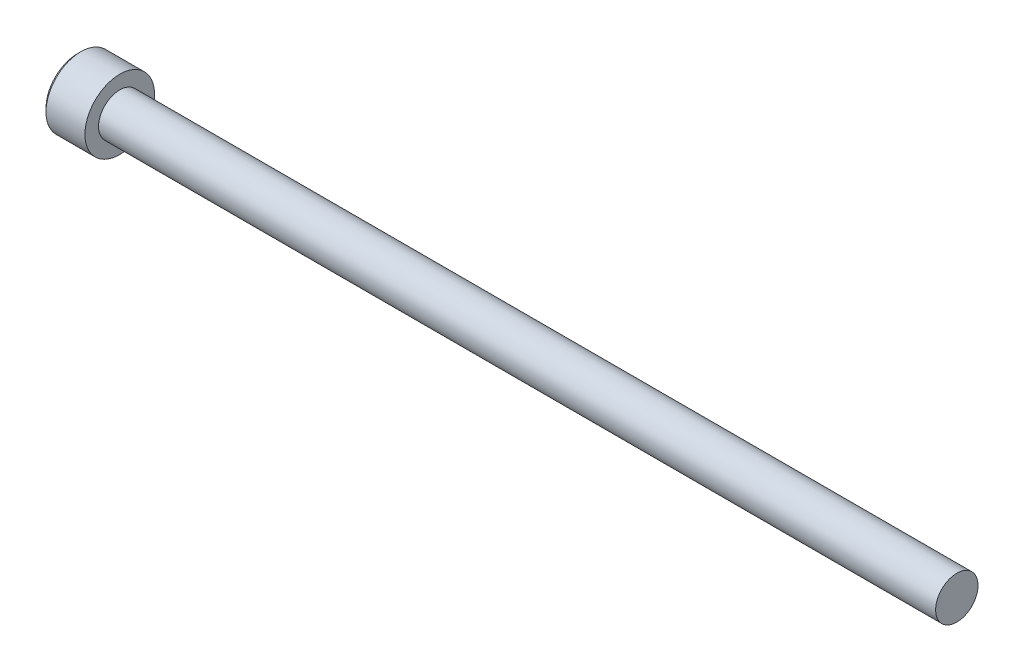
ISO-10303-21;
HEADER;
FILE_DESCRIPTION(('STEP AP214'),'2;1');
FILE_NAME('part.step','',(''),(''),'','','');
FILE_SCHEMA(('AUTOMOTIVE_DESIGN { 1 0 10303 214 1 1 1 1 }'));
ENDSEC;
DATA;
#1=APPLICATION_CONTEXT('core data for automotive mechanical design processes');
#2=APPLICATION_PROTOCOL_DEFINITION('international standard','automotive_design',2000,#1);
#3=PRODUCT_CONTEXT('',#1,'mechanical');
#4=PRODUCT('Part','Part','',(#3));
#5=PRODUCT_RELATED_PRODUCT_CATEGORY('part','',(#4));
#6=PRODUCT_DEFINITION_FORMATION('','',#4);
#7=PRODUCT_DEFINITION_CONTEXT('part definition',#1,'design');
#8=PRODUCT_DEFINITION('design','',#6,#7);
#9=PRODUCT_DEFINITION_SHAPE('','',#8);
#10=(LENGTH_UNIT() NAMED_UNIT(*) SI_UNIT(.MILLI.,.METRE.));
#11=(NAMED_UNIT(*) PLANE_ANGLE_UNIT() SI_UNIT($,.RADIAN.));
#12=(NAMED_UNIT(*) SI_UNIT($,.STERADIAN.) SOLID_ANGLE_UNIT());
#13=UNCERTAINTY_MEASURE_WITH_UNIT(LENGTH_MEASURE(1.E-05),#10,'distance_accuracy_value','');
#14=(GEOMETRIC_REPRESENTATION_CONTEXT(3) GLOBAL_UNCERTAINTY_ASSIGNED_CONTEXT((#13)) GLOBAL_UNIT_ASSIGNED_CONTEXT((#10,
#11,#12)) REPRESENTATION_CONTEXT('',''));
#15=CARTESIAN_POINT('',(0.,0.,0.));
#16=DIRECTION('',(0.,0.,1.));
#17=DIRECTION('',(1.,0.,0.));
#18=AXIS2_PLACEMENT_3D('',#15,#16,#17);
#19=CARTESIAN_POINT('',(-2.28600000000007,-1.14567944042317,1.984375));
#20=DIRECTION('',(0.,0.,1.));
#21=DIRECTION('',(1.,0.,0.));
#22=AXIS2_PLACEMENT_3D('',#19,#20,#21);
#23=PLANE('',#22);
#24=CARTESIAN_POINT('',(-4.82599999995852,1.14567944044653,1.98437499999554));
#25=CARTESIAN_POINT('',(-4.78691618362732,1.06743880343266,1.9843749999984));
#26=CARTESIAN_POINT('',(-4.75011447684892,0.987898318960917,1.98437499999957));
#27=CARTESIAN_POINT('',(-4.68265620500518,0.825677042028778,1.98437500000043));
#28=CARTESIAN_POINT('',(-4.65204056061138,0.742979382529199,1.98437500000012));
#29=CARTESIAN_POINT('',(-4.5991739228306,0.575193959555969,1.98437499999988));
#30=CARTESIAN_POINT('',(-4.57689462080725,0.490115359117279,1.98437499999997));
#31=CARTESIAN_POINT('',(-4.54259467221837,0.318093091130193,1.98437500000003));
#32=CARTESIAN_POINT('',(-4.5305423022885,0.231156054976726,1.984375));
#33=CARTESIAN_POINT('',(-4.52249110263747,0.119918521511051,1.984375));
#34=CARTESIAN_POINT('',(-4.52118947557477,0.0959468443046798,1.984375));
#35=CARTESIAN_POINT('',(-4.51945182629813,0.0479845644411998,1.984375));
#36=CARTESIAN_POINT('',(-4.51901533386223,0.0239939791589393,1.984375));
#37=CARTESIAN_POINT('',(-4.51901809008399,-0.0602201717457363,1.984375));
#38=CARTESIAN_POINT('',(-4.52177452299902,-0.120461721905447,1.984375));
#39=CARTESIAN_POINT('',(-4.5326365512493,-0.240474970989197,1.984375));
#40=CARTESIAN_POINT('',(-4.54074587749718,-0.300246312758427,1.984375));
#41=CARTESIAN_POINT('',(-4.57259622946939,-0.478763752804282,1.984375));
#42=CARTESIAN_POINT('',(-4.60385422611702,-0.596208828937734,1.984375));
#43=CARTESIAN_POINT('',(-4.66780003592237,-0.785921487441256,1.984375));
#44=CARTESIAN_POINT('',(-4.69623457768558,-0.859734609866899,1.984375));
#45=CARTESIAN_POINT('',(-4.75786140400812,-1.00456595519282,1.984375));
#46=CARTESIAN_POINT('',(-4.79100779300359,-1.07560356657101,1.984375));
#47=CARTESIAN_POINT('',(-4.82599999995643,-1.14567944044724,1.984375));
#48=B_SPLINE_CURVE_WITH_KNOTS('',3,(#24,#25,#26,#27,#28,#29,#30,#31,#32,#33,#34,#35,#36,#37,#38,
#39,#40,#41,#42,#43,#44,#45,#46,#47),.UNSPECIFIED.,.F.,.F.,(4,2,2,2,2,2,2,2,2,2,2,4),(0.,
0.262559005207405,0.526801735838036,0.790138824405318,1.05265603861765,1.12466619182083,
1.19663719499031,1.3772702672652,1.55802937209382,1.92104085090328,2.15819130092264,
2.39317265078575),.UNSPECIFIED.);
#49=CARTESIAN_POINT('',(-4.82599999996829,1.14567944041753,1.98437500003084));
#50=VERTEX_POINT('',#49);
#51=CARTESIAN_POINT('',(-4.8259999999622,-1.14567944043207,1.98437500001542));
#52=VERTEX_POINT('',#51);
#53=EDGE_CURVE('E21',#50,#52,#48,.T.);
#54=ORIENTED_EDGE('',*,*,#53,.F.);
#55=DIRECTION('',(1.,0.,0.));
#56=VECTOR('',#55,1.);
#57=CARTESIAN_POINT('',(-2.28600000000007,1.14567944042316,1.984375));
#58=LINE('',#57,#56);
#59=CARTESIAN_POINT('',(-2.28600000000007,1.14567944042316,1.984375));
#60=VERTEX_POINT('',#59);
#61=EDGE_CURVE('E70',#50,#60,#58,.T.);
#62=ORIENTED_EDGE('',*,*,#61,.T.);
#63=DIRECTION('',(0.,1.,0.));
#64=VECTOR('',#63,1.);
#65=CARTESIAN_POINT('',(-2.28600000000007,0.,1.984375));
#66=LINE('',#65,#64);
#67=CARTESIAN_POINT('',(-2.28600000000007,-1.14567944042317,1.984375));
#68=VERTEX_POINT('',#67);
#69=EDGE_CURVE('E76',#68,#60,#66,.T.);
#70=ORIENTED_EDGE('',*,*,#69,.F.);
#71=DIRECTION('',(1.,0.,0.));
#72=VECTOR('',#71,1.);
#73=CARTESIAN_POINT('',(-2.28600000000007,-1.14567944042317,1.984375));
#74=LINE('',#73,#72);
#75=EDGE_CURVE('E73',#68,#52,#74,.F.);
#76=ORIENTED_EDGE('',*,*,#75,.T.);
#77=EDGE_LOOP('',(#54,#62,#70,#76));
#78=FACE_BOUND('',#77,.T.);
#79=ADVANCED_FACE('F17',(#78),#23,.F.);
#80=CARTESIAN_POINT('',(-2.28600000000007,0.,0.));
#81=DIRECTION('',(-1.,0.,0.));
#82=DIRECTION('',(0.,0.,1.));
#83=AXIS2_PLACEMENT_3D('',#80,#81,#82);
#84=PLANE('',#83);
#85=DIRECTION('',(0.,0.5,0.866025403784439));
#86=VECTOR('',#85,1.);
#87=CARTESIAN_POINT('',(-2.28600000000007,2.29135888084633,0.));
#88=LINE('',#87,#86);
#89=CARTESIAN_POINT('',(-2.28600000000007,2.29135888084633,0.));
#90=VERTEX_POINT('',#89);
#91=CARTESIAN_POINT('',(-2.28600000000007,1.14567944042316,-1.984375));
#92=VERTEX_POINT('',#91);
#93=EDGE_CURVE('E84',#90,#92,#88,.F.);
#94=ORIENTED_EDGE('',*,*,#93,.T.);
#95=DIRECTION('',(0.,1.,0.));
#96=VECTOR('',#95,1.);
#97=CARTESIAN_POINT('',(-2.28600000000007,1.14567944042316,-1.984375));
#98=LINE('',#97,#96);
#99=CARTESIAN_POINT('',(-2.28600000000007,-1.14567944042316,-1.984375));
#100=VERTEX_POINT('',#99);
#101=EDGE_CURVE('E249',#92,#100,#98,.F.);
#102=ORIENTED_EDGE('',*,*,#101,.T.);
#103=DIRECTION('',(0.,0.5,-0.866025403784439));
#104=VECTOR('',#103,1.);
#105=CARTESIAN_POINT('',(-2.28600000000007,-1.14567944042316,-1.984375));
#106=LINE('',#105,#104);
#107=CARTESIAN_POINT('',(-2.28600000000007,-2.29135888084633,0.));
#108=VERTEX_POINT('',#107);
#109=EDGE_CURVE('E234',#100,#108,#106,.F.);
#110=ORIENTED_EDGE('',*,*,#109,.T.);
#111=DIRECTION('',(0.,-0.5,-0.866025403784439));
#112=VECTOR('',#111,1.);
#113=CARTESIAN_POINT('',(-2.28600000000007,-2.29135888084633,0.));
#114=LINE('',#113,#112);
#115=EDGE_CURVE('E231',#108,#68,#114,.F.);
#116=ORIENTED_EDGE('',*,*,#115,.T.);
#117=ORIENTED_EDGE('',*,*,#69,.T.);
#118=DIRECTION('',(0.,-0.5,0.866025403784439));
#119=VECTOR('',#118,1.);
#120=CARTESIAN_POINT('',(-2.28600000000007,1.14567944042316,1.984375));
#121=LINE('',#120,#119);
#122=EDGE_CURVE('E83',#60,#90,#121,.F.);
#123=ORIENTED_EDGE('',*,*,#122,.T.);
#124=EDGE_LOOP('',(#94,#102,#110,#116,#117,#123));
#125=FACE_BOUND('',#124,.T.);
#126=ADVANCED_FACE('F166',(#125),#84,.T.);
#127=CARTESIAN_POINT('',(-2.28600000000007,-1.14567944042316,-1.984375));
#128=DIRECTION('',(0.,-0.866025403784439,-0.5));
#129=DIRECTION('',(0.,0.5,-0.866025403784439));
#130=AXIS2_PLACEMENT_3D('',#127,#128,#129);
#131=PLANE('',#130);
#132=CARTESIAN_POINT('',(-4.82599999995871,-1.14567944040756,-1.98437500001887));
#133=CARTESIAN_POINT('',(-4.78666022792997,-1.18505700230148,-1.91617106214563));
#134=CARTESIAN_POINT('',(-4.74963132844072,-1.22509295783734,-1.8468267530301));
#135=CARTESIAN_POINT('',(-4.68183299424977,-1.30673037975396,-1.70542659047317));
#136=CARTESIAN_POINT('',(-4.65110127019237,-1.34833960561553,-1.63335729721673));
#137=CARTESIAN_POINT('',(-4.59845762010516,-1.432242568594,-1.48803310243203));
#138=CARTESIAN_POINT('',(-4.57641341195893,-1.47451494967301,-1.41481519064643));
#139=CARTESIAN_POINT('',(-4.5424501106744,-1.55999007976842,-1.26676792253773));
#140=CARTESIAN_POINT('',(-4.53050567471972,-1.6031902195197,-1.19194308559438));
#141=CARTESIAN_POINT('',(-4.51972842752365,-1.67764765054852,-1.06297903205139));
#142=CARTESIAN_POINT('',(-4.51813352794835,-1.70880881707173,-1.00900630841009));
#143=CARTESIAN_POINT('',(-4.52082392138599,-1.77108016542046,-0.901149169214274));
#144=CARTESIAN_POINT('',(-4.52511127545884,-1.80219032554946,-0.847264791239237));
#145=CARTESIAN_POINT('',(-4.53932219421538,-1.86411684097343,-0.740004920189235));
#146=CARTESIAN_POINT('',(-4.54925206045723,-1.8949328285454,-0.686630064029166));
#147=CARTESIAN_POINT('',(-4.5742029484467,-1.95603190279815,-0.580803363127977));
#148=CARTESIAN_POINT('',(-4.58922357974385,-1.98631503016081,-0.528351447923769));
#149=CARTESIAN_POINT('',(-4.63380478900425,-2.06386502548479,-0.394030915895904));
#150=CARTESIAN_POINT('',(-4.66672213384104,-2.11065153226583,-0.312994309042483));
#151=CARTESIAN_POINT('',(-4.72228952038986,-2.17944749410732,-0.193836207777459));
#152=CARTESIAN_POINT('',(-4.74181309375939,-2.20211890802843,-0.154568166986659));
#153=CARTESIAN_POINT('',(-4.78263970065987,-2.24704195201531,-0.076759172370747));
#154=CARTESIAN_POINT('',(-4.80394164363173,-2.2692938292399,-0.038217790453971));
#155=CARTESIAN_POINT('',(-4.82599999995675,-2.29135888085868,2.13931096249392E-11));
#156=B_SPLINE_CURVE_WITH_KNOTS('',3,(#132,#133,#134,#135,#136,#137,#138,#139,#140,#141,#142,
#143,#144,#145,#146,#147,#148,#149,#150,#151,#152,#153,#154,#155),.UNSPECIFIED.,.F.,.F.,(4,2,2,
2,2,2,2,2,2,2,2,4),(0.,0.264284909626495,0.530108996358093,0.791712695414127,1.05265800174404,
1.23942150116703,1.42625045663858,1.61328847394198,1.80031214908683,2.09727151182814,
2.24534838946042,2.39333511890876),.UNSPECIFIED.);
#157=CARTESIAN_POINT('',(-4.8259999999622,-1.14567944043207,-1.98437500001542));
#158=VERTEX_POINT('',#157);
#159=CARTESIAN_POINT('',(-4.82599999996846,-2.2913588808704,-2.0004354349219E-11));
#160=VERTEX_POINT('',#159);
#161=EDGE_CURVE('E168',#158,#160,#156,.T.);
#162=ORIENTED_EDGE('',*,*,#161,.T.);
#163=DIRECTION('',(1.,0.,0.));
#164=VECTOR('',#163,1.);
#165=CARTESIAN_POINT('',(-2.28600000000007,-2.29135888084633,0.));
#166=LINE('',#165,#164);
#167=EDGE_CURVE('E242',#160,#108,#166,.T.);
#168=ORIENTED_EDGE('',*,*,#167,.T.);
#169=ORIENTED_EDGE('',*,*,#109,.F.);
#170=DIRECTION('',(-1.,0.,0.));
#171=VECTOR('',#170,1.);
#172=CARTESIAN_POINT('',(-2.28600000000007,-1.14567944042316,-1.984375));
#173=LINE('',#172,#171);
#174=EDGE_CURVE('E252',#100,#158,#173,.T.);
#175=ORIENTED_EDGE('',*,*,#174,.T.);
#176=EDGE_LOOP('',(#162,#168,#169,#175));
#177=FACE_BOUND('',#176,.T.);
#178=ADVANCED_FACE('F162',(#177),#131,.F.);
#179=CARTESIAN_POINT('',(-2.28600000000007,-2.29135888084633,0.));
#180=DIRECTION('',(0.,-0.866025403784439,0.5));
#181=DIRECTION('',(0.,-0.5,-0.866025403784439));
#182=AXIS2_PLACEMENT_3D('',#179,#180,#181);
#183=PLANE('',#182);
#184=CARTESIAN_POINT('',(-4.8259999999587,-2.29135888085486,-2.29477011545215E-11));
#185=CARTESIAN_POINT('',(-4.78666022792997,-2.25198131896546,0.0682039378529047));
#186=CARTESIAN_POINT('',(-4.74963132844072,-2.21194536343147,0.137548246969502));
#187=CARTESIAN_POINT('',(-4.68183299424977,-2.13030794151622,0.278948409527228));
#188=CARTESIAN_POINT('',(-4.65110127019237,-2.08869871565414,0.351017702783377));
#189=CARTESIAN_POINT('',(-4.59845762010516,-2.00479575267531,0.496341897567867));
#190=CARTESIAN_POINT('',(-4.57641341195893,-1.96252337159644,0.569559809353539));
#191=CARTESIAN_POINT('',(-4.5424501106744,-1.87704824150112,0.717607077462299));
#192=CARTESIAN_POINT('',(-4.53050567471972,-1.8338481017498,0.792431914405622));
#193=CARTESIAN_POINT('',(-4.51972842752365,-1.75939067072096,0.921395967948603));
#194=CARTESIAN_POINT('',(-4.51813352794834,-1.72822950419776,0.975368691589913));
#195=CARTESIAN_POINT('',(-4.52082392138599,-1.66595815584903,1.08322583078573));
#196=CARTESIAN_POINT('',(-4.52511127545884,-1.63484799572003,1.13711020876076));
#197=CARTESIAN_POINT('',(-4.53932219421538,-1.57292148029607,1.24437007981077));
#198=CARTESIAN_POINT('',(-4.54925206045723,-1.54210549272409,1.29774493597084));
#199=CARTESIAN_POINT('',(-4.5742029484467,-1.48100641847134,1.40357163687202));
#200=CARTESIAN_POINT('',(-4.58922357974385,-1.45072329110868,1.45602355207623));
#201=CARTESIAN_POINT('',(-4.63380478900421,-1.37317329578476,1.59034408410398));
#202=CARTESIAN_POINT('',(-4.66672213384095,-1.32638678900379,1.6713806909573));
#203=CARTESIAN_POINT('',(-4.72228952038968,-1.25759082716239,1.79053879222216));
#204=CARTESIAN_POINT('',(-4.74181309375917,-1.23491941324131,1.82980683301291));
#205=CARTESIAN_POINT('',(-4.78263970065959,-1.18999636925449,1.90761582762872));
#206=CARTESIAN_POINT('',(-4.8039416436314,-1.16774449202993,1.94615720954545));
#207=CARTESIAN_POINT('',(-4.82599999995639,-1.14567944041117,1.98437500002077));
#208=B_SPLINE_CURVE_WITH_KNOTS('',3,(#184,#185,#186,#187,#188,#189,#190,#191,#192,#193,#194,
#195,#196,#197,#198,#199,#200,#201,#202,#203,#204,#205,#206,#207),.UNSPECIFIED.,.F.,.F.,(4,2,2,
2,2,2,2,2,2,2,2,4),(0.,0.264284909626493,0.530108996358089,0.791712695414125,1.05265800174404,
1.23942150116703,1.42625045663858,1.61328847394198,1.80031214908683,2.09727151182773,
2.24534838945981,2.39333511890795),.UNSPECIFIED.);
#209=EDGE_CURVE('E93',#160,#52,#208,.T.);
#210=ORIENTED_EDGE('',*,*,#209,.T.);
#211=ORIENTED_EDGE('',*,*,#75,.F.);
#212=ORIENTED_EDGE('',*,*,#115,.F.);
#213=ORIENTED_EDGE('',*,*,#167,.F.);
#214=EDGE_LOOP('',(#210,#211,#212,#213));
#215=FACE_BOUND('',#214,.T.);
#216=ADVANCED_FACE('F157',(#215),#183,.F.);
#217=CARTESIAN_POINT('',(-2.28600000000007,1.14567944042316,1.984375));
#218=DIRECTION('',(0.,0.866025403784439,0.5));
#219=DIRECTION('',(0.,-0.5,0.866025403784439));
#220=AXIS2_PLACEMENT_3D('',#217,#218,#219);
#221=PLANE('',#220);
#222=CARTESIAN_POINT('',(-4.82599999995852,1.14567944040762,1.98437500001801));
#223=CARTESIAN_POINT('',(-4.78666022792973,1.1850570023017,1.91617106214498));
#224=CARTESIAN_POINT('',(-4.74963132844047,1.22509295783761,1.84682675302957));
#225=CARTESIAN_POINT('',(-4.68183299424957,1.30673037975422,1.70542659047278));
#226=CARTESIAN_POINT('',(-4.65110127019222,1.34833960561574,1.63335729721638));
#227=CARTESIAN_POINT('',(-4.59845762010509,1.43224256859413,1.48803310243178));
#228=CARTESIAN_POINT('',(-4.57641341195888,1.47451494967311,1.41481519064625));
#229=CARTESIAN_POINT('',(-4.54245011067439,1.55999007976846,1.26676792253767));
#230=CARTESIAN_POINT('',(-4.53050567471972,1.6031902195197,1.19194308559439));
#231=CARTESIAN_POINT('',(-4.51972842752365,1.67764765054848,1.06297903205146));
#232=CARTESIAN_POINT('',(-4.51813352794835,1.70880881707169,1.00900630841016));
#233=CARTESIAN_POINT('',(-4.52082392138598,1.77108016542041,0.901149169214364));
#234=CARTESIAN_POINT('',(-4.52511127545883,1.80219032554941,0.847264791239333));
#235=CARTESIAN_POINT('',(-4.53932219421536,1.86411684097336,0.740004920189342));
#236=CARTESIAN_POINT('',(-4.54925206045721,1.89493282854533,0.686630064029279));
#237=CARTESIAN_POINT('',(-4.57420294844667,1.95603190279808,0.580803363128101));
#238=CARTESIAN_POINT('',(-4.58922357974382,1.98631503016074,0.528351447923897));
#239=CARTESIAN_POINT('',(-4.6338047890042,2.06386502548473,0.394030915896012));
#240=CARTESIAN_POINT('',(-4.666722133841,2.11065153226578,0.312994309042568));
#241=CARTESIAN_POINT('',(-4.72228952038984,2.17944749410729,0.19383620777751));
#242=CARTESIAN_POINT('',(-4.74181309375937,2.20211890802841,0.1545681669867));
#243=CARTESIAN_POINT('',(-4.78263970065986,2.24704195201529,0.0767591723707675));
#244=CARTESIAN_POINT('',(-4.80394164363172,2.26929382923989,0.0382177904539812));
#245=CARTESIAN_POINT('',(-4.82599999995675,2.29135888085868,-2.13928869462937E-11));
#246=B_SPLINE_CURVE_WITH_KNOTS('',3,(#222,#223,#224,#225,#226,#227,#228,#229,#230,#231,#232,
#233,#234,#235,#236,#237,#238,#239,#240,#241,#242,#243,#244,#245),.UNSPECIFIED.,.F.,.F.,(4,2,2,
2,2,2,2,2,2,2,2,4),(0.,0.26428490962629,0.530108996357672,0.791712695413487,1.05265800174319,
1.23942150116616,1.42625045663768,1.61328847394106,1.80031214908589,2.09727151182728,
2.2453483894596,2.39333511890798),.UNSPECIFIED.);
#247=CARTESIAN_POINT('',(-4.82599999996846,2.29135888087039,2.00042061036289E-11));
#248=VERTEX_POINT('',#247);
#249=EDGE_CURVE('E81',#50,#248,#246,.T.);
#250=ORIENTED_EDGE('',*,*,#249,.T.);
#251=DIRECTION('',(1.,0.,0.));
#252=VECTOR('',#251,1.);
#253=CARTESIAN_POINT('',(-2.28600000000007,2.29135888084633,0.));
#254=LINE('',#253,#252);
#255=EDGE_CURVE('E253',#248,#90,#254,.T.);
#256=ORIENTED_EDGE('',*,*,#255,.T.);
#257=ORIENTED_EDGE('',*,*,#122,.F.);
#258=ORIENTED_EDGE('',*,*,#61,.F.);
#259=EDGE_LOOP('',(#250,#256,#257,#258));
#260=FACE_BOUND('',#259,.T.);
#261=ADVANCED_FACE('F78',(#260),#221,.F.);
#262=CARTESIAN_POINT('',(-2.28600000000007,2.29135888084633,0.));
#263=DIRECTION('',(0.,0.866025403784439,-0.5));
#264=DIRECTION('',(0.,0.5,0.866025403784439));
#265=AXIS2_PLACEMENT_3D('',#262,#263,#264);
#266=PLANE('',#265);
#267=CARTESIAN_POINT('',(-4.82599999995871,2.29135888085486,2.29489280696873E-11));
#268=CARTESIAN_POINT('',(-4.78666022792997,2.25198131896546,-0.0682039378529041));
#269=CARTESIAN_POINT('',(-4.74963132844072,2.21194536343147,-0.137548246969502));
#270=CARTESIAN_POINT('',(-4.68183299424977,2.13030794151622,-0.278948409527229));
#271=CARTESIAN_POINT('',(-4.65110127019237,2.08869871565414,-0.351017702783379));
#272=CARTESIAN_POINT('',(-4.59845762010516,2.00479575267531,-0.496341897567869));
#273=CARTESIAN_POINT('',(-4.57641341195893,1.96252337159644,-0.569559809353541));
#274=CARTESIAN_POINT('',(-4.5424501106744,1.87704824150112,-0.7176070774623));
#275=CARTESIAN_POINT('',(-4.53050567471972,1.8338481017498,-0.792431914405622));
#276=CARTESIAN_POINT('',(-4.51972842752365,1.75939067072096,-0.921395967948602));
#277=CARTESIAN_POINT('',(-4.51813352794835,1.72822950419776,-0.975368691589912));
#278=CARTESIAN_POINT('',(-4.52082392138599,1.66595815584903,-1.08322583078573));
#279=CARTESIAN_POINT('',(-4.52511127545884,1.63484799572003,-1.13711020876076));
#280=CARTESIAN_POINT('',(-4.53932219421538,1.57292148029607,-1.24437007981077));
#281=CARTESIAN_POINT('',(-4.54925206045723,1.54210549272409,-1.29774493597083));
#282=CARTESIAN_POINT('',(-4.5742029484467,1.48100641847134,-1.40357163687202));
#283=CARTESIAN_POINT('',(-4.58922357974385,1.45072329110868,-1.45602355207623));
#284=CARTESIAN_POINT('',(-4.63380478900425,1.3731732957847,-1.5903440841041));
#285=CARTESIAN_POINT('',(-4.66672213384104,1.32638678900366,-1.67138069095752));
#286=CARTESIAN_POINT('',(-4.72228952038986,1.25759082716218,-1.79053879222254));
#287=CARTESIAN_POINT('',(-4.74181309375939,1.23491941324106,-1.82980683301334));
#288=CARTESIAN_POINT('',(-4.78263970065987,1.18999636925419,-1.90761582762925));
#289=CARTESIAN_POINT('',(-4.80394164363173,1.1677444920296,-1.94615720954603));
#290=CARTESIAN_POINT('',(-4.82599999995675,1.14567944041081,-1.98437500002139));
#291=B_SPLINE_CURVE_WITH_KNOTS('',3,(#267,#268,#269,#270,#271,#272,#273,#274,#275,#276,#277,
#278,#279,#280,#281,#282,#283,#284,#285,#286,#287,#288,#289,#290),.UNSPECIFIED.,.F.,.F.,(4,2,2,
2,2,2,2,2,2,2,2,4),(0.,0.264284909626495,0.530108996358094,0.791712695414128,1.05265800174404,
1.23942150116703,1.42625045663858,1.61328847394198,1.80031214908683,2.09727151182814,
2.24534838946042,2.39333511890876),.UNSPECIFIED.);
#292=CARTESIAN_POINT('',(-4.82599999996846,1.14567944045252,-1.98437500001084));
#293=VERTEX_POINT('',#292);
#294=EDGE_CURVE('E41',#248,#293,#291,.T.);
#295=ORIENTED_EDGE('',*,*,#294,.T.);
#296=DIRECTION('',(-1.,0.,0.));
#297=VECTOR('',#296,1.);
#298=CARTESIAN_POINT('',(-2.28600000000007,1.14567944042316,-1.984375));
#299=LINE('',#298,#297);
#300=EDGE_CURVE('E173',#293,#92,#299,.F.);
#301=ORIENTED_EDGE('',*,*,#300,.T.);
#302=ORIENTED_EDGE('',*,*,#93,.F.);
#303=ORIENTED_EDGE('',*,*,#255,.F.);
#304=EDGE_LOOP('',(#295,#301,#302,#303));
#305=FACE_BOUND('',#304,.T.);
#306=ADVANCED_FACE('F156',(#305),#266,.F.);
#307=CARTESIAN_POINT('',(-2.28600000000007,1.14567944042316,-1.984375));
#308=DIRECTION('',(0.,0.,-1.));
#309=DIRECTION('',(-1.,0.,0.));
#310=AXIS2_PLACEMENT_3D('',#307,#308,#309);
#311=PLANE('',#310);
#312=CARTESIAN_POINT('',(-4.8259999999587,1.14567944044731,-1.98437499999592));
#313=CARTESIAN_POINT('',(-4.78666022793094,1.06692431665146,-1.98437499999853));
#314=CARTESIAN_POINT('',(-4.74963132844318,0.986852405569011,-1.98437499999961));
#315=CARTESIAN_POINT('',(-4.6818329942566,0.823577561711963,-1.9843750000004));
#316=CARTESIAN_POINT('',(-4.65110127020207,0.740359109975722,-1.98437500000011));
#317=CARTESIAN_POINT('',(-4.59845762012233,0.572553183993917,-1.9843749999999));
#318=CARTESIAN_POINT('',(-4.57641341198063,0.488008421824127,-1.98437499999997));
#319=CARTESIAN_POINT('',(-4.54245011070673,0.317058161610178,-1.98437500000003));
#320=CARTESIAN_POINT('',(-4.53050567475816,0.230657882096267,-1.98437500000001));
#321=CARTESIAN_POINT('',(-4.51972842757294,0.0817430200124032,-1.984375));
#322=CARTESIAN_POINT('',(-4.51813352800283,0.0194206869508218,-1.984375));
#323=CARTESIAN_POINT('',(-4.52082392145254,-0.1051220097764,-1.984375));
#324=CARTESIAN_POINT('',(-4.52511127553227,-0.167342330049008,-1.984375));
#325=CARTESIAN_POINT('',(-4.53932219430377,-0.291195360925477,-1.984375));
#326=CARTESIAN_POINT('',(-4.54925206055372,-0.352827336083362,-1.984375));
#327=CARTESIAN_POINT('',(-4.57420294856008,-0.475025484616114,-1.984375));
#328=CARTESIAN_POINT('',(-4.58922357986604,-0.535591739354747,-1.984375));
#329=CARTESIAN_POINT('',(-4.63380478912724,-0.690691729958653,-1.984375));
#330=CARTESIAN_POINT('',(-4.66672213394715,-0.784264743465576,-1.984375));
#331=CARTESIAN_POINT('',(-4.7222895204619,-0.921856667069616,-1.984375));
#332=CARTESIAN_POINT('',(-4.74181309381856,-0.967199494886089,-1.984375));
#333=CARTESIAN_POINT('',(-4.78263970069104,-1.05704558280959,-1.984375));
#334=CARTESIAN_POINT('',(-4.80394164364776,-1.10154933723428,-1.984375));
#335=CARTESIAN_POINT('',(-4.82599999995675,-1.14567944044787,-1.984375));
#336=B_SPLINE_CURVE_WITH_KNOTS('',3,(#312,#313,#314,#315,#316,#317,#318,#319,#320,#321,#322,
#323,#324,#325,#326,#327,#328,#329,#330,#331,#332,#333,#334,#335),.UNSPECIFIED.,.F.,.F.,(4,2,2,
2,2,2,2,2,2,2,2,4),(0.,0.264284909658836,0.530108996422784,0.791712695509868,1.0526580018708,
1.23942150133878,1.42625045685537,1.61328847420389,1.80031214939384,2.09727151196384,
2.24534838950992,2.39333511887245),.UNSPECIFIED.);
#337=EDGE_CURVE('E110',#293,#158,#336,.T.);
#338=ORIENTED_EDGE('',*,*,#337,.T.);
#339=ORIENTED_EDGE('',*,*,#174,.F.);
#340=ORIENTED_EDGE('',*,*,#101,.F.);
#341=ORIENTED_EDGE('',*,*,#300,.F.);
#342=EDGE_LOOP('',(#338,#339,#340,#341));
#343=FACE_BOUND('',#342,.T.);
#344=ADVANCED_FACE('F125',(#343),#311,.F.);
#345=CARTESIAN_POINT('',(-4.82599999998001,0.,0.));
#346=DIRECTION('',(-1.,0.,0.));
#347=DIRECTION('',(0.,0.,1.));
#348=AXIS2_PLACEMENT_3D('',#345,#346,#347);
#349=CONICAL_SURFACE('',#348,2.29135888088194,0.785398163397448);
#350=ORIENTED_EDGE('',*,*,#161,.F.);
#351=CARTESIAN_POINT('',(-4.82599999998001,0.,0.));
#352=DIRECTION('',(-1.,0.,0.));
#353=DIRECTION('',(0.,0.,1.));
#354=AXIS2_PLACEMENT_3D('',#351,#352,#353);
#355=CIRCLE('',#354,2.29135888088194);
#356=EDGE_CURVE('E107',#158,#160,#355,.T.);
#357=ORIENTED_EDGE('',*,*,#356,.T.);
#358=EDGE_LOOP('',(#350,#357));
#359=FACE_BOUND('',#358,.T.);
#360=ADVANCED_FACE('F174',(#359),#349,.F.);
#361=CARTESIAN_POINT('',(-4.82599999998001,0.,0.));
#362=DIRECTION('',(-1.,0.,0.));
#363=DIRECTION('',(0.,0.,1.));
#364=AXIS2_PLACEMENT_3D('',#361,#362,#363);
#365=CONICAL_SURFACE('',#364,2.29135888088194,0.785398163397448);
#366=ORIENTED_EDGE('',*,*,#209,.F.);
#367=CARTESIAN_POINT('',(-4.82599999998001,0.,0.));
#368=DIRECTION('',(-1.,0.,0.));
#369=DIRECTION('',(0.,0.,1.));
#370=AXIS2_PLACEMENT_3D('',#367,#368,#369);
#371=CIRCLE('',#370,2.29135888088194);
#372=EDGE_CURVE('E88',#160,#52,#371,.T.);
#373=ORIENTED_EDGE('',*,*,#372,.T.);
#374=EDGE_LOOP('',(#366,#373));
#375=FACE_BOUND('',#374,.T.);
#376=ADVANCED_FACE('F177',(#375),#365,.F.);
#377=CARTESIAN_POINT('',(-4.82599999998001,0.,0.));
#378=DIRECTION('',(-1.,0.,0.));
#379=DIRECTION('',(0.,0.,1.));
#380=AXIS2_PLACEMENT_3D('',#377,#378,#379);
#381=CONICAL_SURFACE('',#380,2.29135888088194,0.78539816348948);
#382=CARTESIAN_POINT('',(-4.82599999998001,0.,0.));
#383=DIRECTION('',(-1.,0.,0.));
#384=DIRECTION('',(0.,0.,1.));
#385=AXIS2_PLACEMENT_3D('',#382,#383,#384);
#386=CIRCLE('',#385,2.29135888088194);
#387=EDGE_CURVE('E61',#52,#50,#386,.T.);
#388=ORIENTED_EDGE('',*,*,#387,.T.);
#389=ORIENTED_EDGE('',*,*,#53,.T.);
#390=EDGE_LOOP('',(#388,#389));
#391=FACE_BOUND('',#390,.T.);
#392=ADVANCED_FACE('F86',(#391),#381,.F.);
#393=CARTESIAN_POINT('',(-4.82599999998001,0.,0.));
#394=DIRECTION('',(-1.,0.,0.));
#395=DIRECTION('',(0.,0.,1.));
#396=AXIS2_PLACEMENT_3D('',#393,#394,#395);
#397=CONICAL_SURFACE('',#396,2.29135888088194,0.785398163397448);
#398=ORIENTED_EDGE('',*,*,#249,.F.);
#399=CARTESIAN_POINT('',(-4.82599999998001,0.,0.));
#400=DIRECTION('',(-1.,0.,0.));
#401=DIRECTION('',(0.,0.,1.));
#402=AXIS2_PLACEMENT_3D('',#399,#400,#401);
#403=CIRCLE('',#402,2.29135888088194);
#404=EDGE_CURVE('E87',#50,#248,#403,.T.);
#405=ORIENTED_EDGE('',*,*,#404,.T.);
#406=EDGE_LOOP('',(#398,#405));
#407=FACE_BOUND('',#406,.T.);
#408=ADVANCED_FACE('F92',(#407),#397,.F.);
#409=CARTESIAN_POINT('',(-4.82599999998001,0.,0.));
#410=DIRECTION('',(-1.,0.,0.));
#411=DIRECTION('',(0.,0.,1.));
#412=AXIS2_PLACEMENT_3D('',#409,#410,#411);
#413=CONICAL_SURFACE('',#412,2.29135888088194,0.785398163397448);
#414=ORIENTED_EDGE('',*,*,#294,.F.);
#415=CARTESIAN_POINT('',(-4.82599999998001,0.,0.));
#416=DIRECTION('',(-1.,0.,0.));
#417=DIRECTION('',(0.,0.,1.));
#418=AXIS2_PLACEMENT_3D('',#415,#416,#417);
#419=CIRCLE('',#418,2.29135888088194);
#420=EDGE_CURVE('E99',#248,#293,#419,.T.);
#421=ORIENTED_EDGE('',*,*,#420,.T.);
#422=EDGE_LOOP('',(#414,#421));
#423=FACE_BOUND('',#422,.T.);
#424=ADVANCED_FACE('F132',(#423),#413,.F.);
#425=CARTESIAN_POINT('',(-4.82599999998001,0.,0.));
#426=DIRECTION('',(-1.,0.,0.));
#427=DIRECTION('',(0.,0.,1.));
#428=AXIS2_PLACEMENT_3D('',#425,#426,#427);
#429=CONICAL_SURFACE('',#428,2.29135888088194,0.785398163489476);
#430=ORIENTED_EDGE('',*,*,#337,.F.);
#431=CARTESIAN_POINT('',(-4.82599999998001,0.,0.));
#432=DIRECTION('',(-1.,0.,0.));
#433=DIRECTION('',(0.,0.,1.));
#434=AXIS2_PLACEMENT_3D('',#431,#432,#433);
#435=CIRCLE('',#434,2.29135888088194);
#436=EDGE_CURVE('E101',#293,#158,#435,.T.);
#437=ORIENTED_EDGE('',*,*,#436,.T.);
#438=EDGE_LOOP('',(#430,#437));
#439=FACE_BOUND('',#438,.T.);
#440=ADVANCED_FACE('F128',(#439),#429,.F.);
#441=CARTESIAN_POINT('',(-4.82600000000007,0.,0.));
#442=DIRECTION('',(1.,0.,0.));
#443=DIRECTION('',(0.,0.,-1.));
#444=AXIS2_PLACEMENT_3D('',#441,#442,#443);
#445=PLANE('',#444);
#446=CARTESIAN_POINT('',(-4.82599999998001,0.,0.));
#447=DIRECTION('',(1.,0.,0.));
#448=DIRECTION('',(0.,0.,-1.));
#449=AXIS2_PLACEMENT_3D('',#446,#447,#448);
#450=CIRCLE('',#449,3.56615999999121);
#451=CARTESIAN_POINT('',(-4.82599999998001,0.,-3.56615999999121));
#452=VERTEX_POINT('',#451);
#453=EDGE_CURVE('E219',#452,#452,#450,.T.);
#454=ORIENTED_EDGE('',*,*,#453,.F.);
#455=EDGE_LOOP('',(#454));
#456=FACE_BOUND('',#455,.T.);
#457=ORIENTED_EDGE('',*,*,#420,.F.);
#458=ORIENTED_EDGE('',*,*,#404,.F.);
#459=ORIENTED_EDGE('',*,*,#387,.F.);
#460=ORIENTED_EDGE('',*,*,#372,.F.);
#461=ORIENTED_EDGE('',*,*,#356,.F.);
#462=ORIENTED_EDGE('',*,*,#436,.F.);
#463=EDGE_LOOP('',(#457,#458,#459,#460,#461,#462));
#464=FACE_BOUND('',#463,.T.);
#465=ADVANCED_FACE('F96',(#456,#464),#445,.F.);
#466=CARTESIAN_POINT('',(-4.42976000010731,0.,0.));
#467=DIRECTION('',(1.,0.,0.));
#468=DIRECTION('',(0.,0.,-1.));
#469=AXIS2_PLACEMENT_3D('',#466,#467,#468);
#470=CONICAL_SURFACE('',#469,3.96239999986392,0.785398163397448);
#471=CARTESIAN_POINT('',(-4.42976000000007,0.,0.));
#472=DIRECTION('',(-1.,0.,0.));
#473=DIRECTION('',(0.,0.,1.));
#474=AXIS2_PLACEMENT_3D('',#471,#472,#473);
#475=CIRCLE('',#474,3.9624);
#476=CARTESIAN_POINT('',(-4.42976000000007,0.,3.9624));
#477=VERTEX_POINT('',#476);
#478=EDGE_CURVE('E216',#477,#477,#475,.F.);
#479=ORIENTED_EDGE('',*,*,#478,.F.);
#480=EDGE_LOOP('',(#479));
#481=FACE_BOUND('',#480,.T.);
#482=ORIENTED_EDGE('',*,*,#453,.T.);
#483=EDGE_LOOP('',(#482));
#484=FACE_BOUND('',#483,.T.);
#485=ADVANCED_FACE('F205',(#481,#484),#470,.T.);
#486=CARTESIAN_POINT('',(-4.82600000000008,0.,0.));
#487=DIRECTION('',(-1.,0.,0.));
#488=DIRECTION('',(0.,0.,1.));
#489=AXIS2_PLACEMENT_3D('',#486,#487,#488);
#490=CYLINDRICAL_SURFACE('',#489,3.9624);
#491=ORIENTED_EDGE('',*,*,#478,.T.);
#492=EDGE_LOOP('',(#491));
#493=FACE_BOUND('',#492,.T.);
#494=CARTESIAN_POINT('',(0.,0.,0.));
#495=DIRECTION('',(-1.,0.,0.));
#496=DIRECTION('',(0.,0.,1.));
#497=AXIS2_PLACEMENT_3D('',#494,#495,#496);
#498=CIRCLE('',#497,3.9624);
#499=CARTESIAN_POINT('',(0.,0.,3.9624));
#500=VERTEX_POINT('',#499);
#501=EDGE_CURVE('E221',#500,#500,#498,.T.);
#502=ORIENTED_EDGE('',*,*,#501,.T.);
#503=EDGE_LOOP('',(#502));
#504=FACE_BOUND('',#503,.T.);
#505=ADVANCED_FACE('F202',(#493,#504),#490,.T.);
#506=CARTESIAN_POINT('',(95.25,0.,0.));
#507=DIRECTION('',(1.,0.,0.));
#508=DIRECTION('',(0.,0.,-1.));
#509=AXIS2_PLACEMENT_3D('',#506,#507,#508);
#510=PLANE('',#509);
#511=CARTESIAN_POINT('',(95.25,0.,0.));
#512=DIRECTION('',(-1.,0.,0.));
#513=DIRECTION('',(0.,0.,1.));
#514=AXIS2_PLACEMENT_3D('',#511,#512,#513);
#515=CIRCLE('',#514,2.413);
#516=CARTESIAN_POINT('',(95.25,0.,2.413));
#517=VERTEX_POINT('',#516);
#518=EDGE_CURVE('E32',#517,#517,#515,.T.);
#519=ORIENTED_EDGE('',*,*,#518,.F.);
#520=EDGE_LOOP('',(#519));
#521=FACE_BOUND('',#520,.T.);
#522=ADVANCED_FACE('F195',(#521),#510,.T.);
#523=CARTESIAN_POINT('',(0.,3.9624,0.));
#524=DIRECTION('',(-1.,0.,0.));
#525=DIRECTION('',(0.,0.,1.));
#526=AXIS2_PLACEMENT_3D('',#523,#524,#525);
#527=PLANE('',#526);
#528=CARTESIAN_POINT('',(0.,0.,0.));
#529=DIRECTION('',(-1.,0.,0.));
#530=DIRECTION('',(0.,0.,1.));
#531=AXIS2_PLACEMENT_3D('',#528,#529,#530);
#532=CIRCLE('',#531,2.413);
#533=CARTESIAN_POINT('',(0.,0.,2.413));
#534=VERTEX_POINT('',#533);
#535=EDGE_CURVE('E11',#534,#534,#532,.F.);
#536=ORIENTED_EDGE('',*,*,#535,.F.);
#537=EDGE_LOOP('',(#536));
#538=FACE_BOUND('',#537,.T.);
#539=ORIENTED_EDGE('',*,*,#501,.F.);
#540=EDGE_LOOP('',(#539));
#541=FACE_BOUND('',#540,.T.);
#542=ADVANCED_FACE('F189',(#538,#541),#527,.F.);
#543=CARTESIAN_POINT('',(95.25,0.,0.));
#544=DIRECTION('',(-1.,0.,0.));
#545=DIRECTION('',(0.,0.,1.));
#546=AXIS2_PLACEMENT_3D('',#543,#544,#545);
#547=CYLINDRICAL_SURFACE('',#546,2.413);
#548=ORIENTED_EDGE('',*,*,#535,.T.);
#549=EDGE_LOOP('',(#548));
#550=FACE_BOUND('',#549,.T.);
#551=ORIENTED_EDGE('',*,*,#518,.T.);
#552=EDGE_LOOP('',(#551));
#553=FACE_BOUND('',#552,.T.);
#554=ADVANCED_FACE('F187',(#550,#553),#547,.T.);
#555=CLOSED_SHELL('',(#79,#126,#178,#216,#261,#306,#344,#360,#376,#392,#408,#424,#440,#465,#485,
#505,#522,#542,#554));
#556=MANIFOLD_SOLID_BREP('B1',#555);
#557=ADVANCED_BREP_SHAPE_REPRESENTATION('',(#18,#556),#14);
#558=SHAPE_DEFINITION_REPRESENTATION(#9,#557);
ENDSEC;
END-ISO-10303-21;
